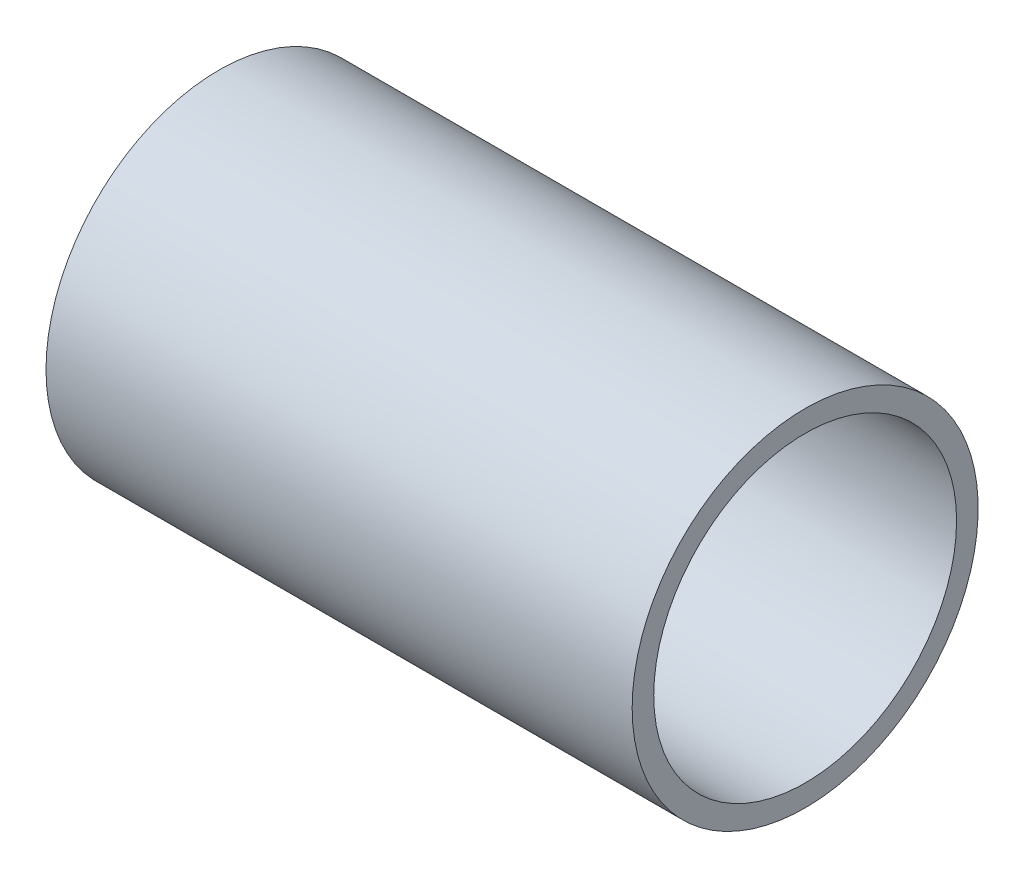
ISO-10303-21;
HEADER;
FILE_DESCRIPTION(('STEP AP214'),'2;1');
FILE_NAME('part.step','',(''),(''),'','','');
FILE_SCHEMA(('AUTOMOTIVE_DESIGN { 1 0 10303 214 1 1 1 1 }'));
ENDSEC;
DATA;
#1=APPLICATION_CONTEXT('core data for automotive mechanical design processes');
#2=APPLICATION_PROTOCOL_DEFINITION('international standard','automotive_design',2000,#1);
#3=PRODUCT_CONTEXT('',#1,'mechanical');
#4=PRODUCT('Part','Part','',(#3));
#5=PRODUCT_RELATED_PRODUCT_CATEGORY('part','',(#4));
#6=PRODUCT_DEFINITION_FORMATION('','',#4);
#7=PRODUCT_DEFINITION_CONTEXT('part definition',#1,'design');
#8=PRODUCT_DEFINITION('design','',#6,#7);
#9=PRODUCT_DEFINITION_SHAPE('','',#8);
#10=(LENGTH_UNIT() NAMED_UNIT(*) SI_UNIT(.MILLI.,.METRE.));
#11=(NAMED_UNIT(*) PLANE_ANGLE_UNIT() SI_UNIT($,.RADIAN.));
#12=(NAMED_UNIT(*) SI_UNIT($,.STERADIAN.) SOLID_ANGLE_UNIT());
#13=UNCERTAINTY_MEASURE_WITH_UNIT(LENGTH_MEASURE(1.E-05),#10,'distance_accuracy_value','');
#14=(GEOMETRIC_REPRESENTATION_CONTEXT(3) GLOBAL_UNCERTAINTY_ASSIGNED_CONTEXT((#13)) GLOBAL_UNIT_ASSIGNED_CONTEXT((#10,
#11,#12)) REPRESENTATION_CONTEXT('',''));
#15=CARTESIAN_POINT('',(0.,0.,0.));
#16=DIRECTION('',(0.,0.,1.));
#17=DIRECTION('',(1.,0.,0.));
#18=AXIS2_PLACEMENT_3D('',#15,#16,#17);
#19=CARTESIAN_POINT('',(0.,141.732,0.));
#20=DIRECTION('',(1.,0.,0.));
#21=DIRECTION('',(0.,0.,-1.));
#22=AXIS2_PLACEMENT_3D('',#19,#20,#21);
#23=PLANE('',#22);
#24=CARTESIAN_POINT('',(0.,0.,0.));
#25=DIRECTION('',(-1.,0.,0.));
#26=DIRECTION('',(0.,0.,1.));
#27=AXIS2_PLACEMENT_3D('',#24,#25,#26);
#28=CIRCLE('',#27,141.732);
#29=CARTESIAN_POINT('',(0.,0.,141.732));
#30=VERTEX_POINT('',#29);
#31=EDGE_CURVE('E46',#30,#30,#28,.T.);
#32=ORIENTED_EDGE('',*,*,#31,.F.);
#33=EDGE_LOOP('',(#32));
#34=FACE_BOUND('',#33,.T.);
#35=CARTESIAN_POINT('',(0.,0.,0.));
#36=DIRECTION('',(-1.,0.,0.));
#37=DIRECTION('',(0.,0.,1.));
#38=AXIS2_PLACEMENT_3D('',#35,#36,#37);
#39=CIRCLE('',#38,161.925);
#40=CARTESIAN_POINT('',(0.,0.,161.925));
#41=VERTEX_POINT('',#40);
#42=EDGE_CURVE('E10',#41,#41,#39,.T.);
#43=ORIENTED_EDGE('',*,*,#42,.T.);
#44=EDGE_LOOP('',(#43));
#45=FACE_BOUND('',#44,.T.);
#46=ADVANCED_FACE('F32',(#34,#45),#23,.F.);
#47=CARTESIAN_POINT('',(0.,0.,0.));
#48=DIRECTION('',(-1.,0.,0.));
#49=DIRECTION('',(0.,0.,1.));
#50=AXIS2_PLACEMENT_3D('',#47,#48,#49);
#51=CYLINDRICAL_SURFACE('',#50,161.925);
#52=ORIENTED_EDGE('',*,*,#42,.F.);
#53=EDGE_LOOP('',(#52));
#54=FACE_BOUND('',#53,.T.);
#55=CARTESIAN_POINT('',(548.64,0.,0.));
#56=DIRECTION('',(-1.,0.,0.));
#57=DIRECTION('',(0.,0.,1.));
#58=AXIS2_PLACEMENT_3D('',#55,#56,#57);
#59=CIRCLE('',#58,161.925);
#60=CARTESIAN_POINT('',(548.64,0.,161.925));
#61=VERTEX_POINT('',#60);
#62=EDGE_CURVE('E38',#61,#61,#59,.T.);
#63=ORIENTED_EDGE('',*,*,#62,.T.);
#64=EDGE_LOOP('',(#63));
#65=FACE_BOUND('',#64,.T.);
#66=ADVANCED_FACE('F55',(#54,#65),#51,.T.);
#67=CARTESIAN_POINT('',(548.64,141.732,0.));
#68=DIRECTION('',(-1.,0.,0.));
#69=DIRECTION('',(0.,0.,1.));
#70=AXIS2_PLACEMENT_3D('',#67,#68,#69);
#71=PLANE('',#70);
#72=ORIENTED_EDGE('',*,*,#62,.F.);
#73=EDGE_LOOP('',(#72));
#74=FACE_BOUND('',#73,.T.);
#75=CARTESIAN_POINT('',(548.64,0.,0.));
#76=DIRECTION('',(-1.,0.,0.));
#77=DIRECTION('',(0.,0.,1.));
#78=AXIS2_PLACEMENT_3D('',#75,#76,#77);
#79=CIRCLE('',#78,141.732);
#80=CARTESIAN_POINT('',(548.64,0.,141.732));
#81=VERTEX_POINT('',#80);
#82=EDGE_CURVE('E42',#81,#81,#79,.T.);
#83=ORIENTED_EDGE('',*,*,#82,.T.);
#84=EDGE_LOOP('',(#83));
#85=FACE_BOUND('',#84,.T.);
#86=ADVANCED_FACE('F59',(#74,#85),#71,.F.);
#87=CARTESIAN_POINT('',(0.,0.,0.));
#88=DIRECTION('',(-1.,0.,0.));
#89=DIRECTION('',(0.,0.,1.));
#90=AXIS2_PLACEMENT_3D('',#87,#88,#89);
#91=CYLINDRICAL_SURFACE('',#90,141.732);
#92=ORIENTED_EDGE('',*,*,#82,.F.);
#93=EDGE_LOOP('',(#92));
#94=FACE_BOUND('',#93,.T.);
#95=ORIENTED_EDGE('',*,*,#31,.T.);
#96=EDGE_LOOP('',(#95));
#97=FACE_BOUND('',#96,.T.);
#98=ADVANCED_FACE('F52',(#94,#97),#91,.F.);
#99=CLOSED_SHELL('',(#46,#66,#86,#98));
#100=MANIFOLD_SOLID_BREP('B2',#99);
#101=ADVANCED_BREP_SHAPE_REPRESENTATION('',(#18,#100),#14);
#102=SHAPE_DEFINITION_REPRESENTATION(#9,#101);
ENDSEC;
END-ISO-10303-21;
